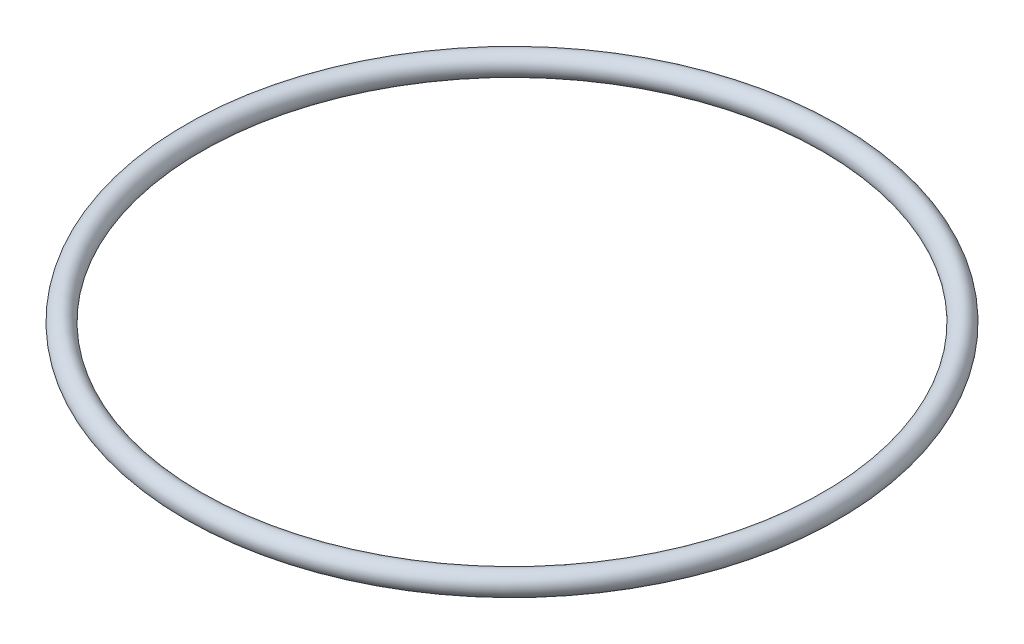
ISO-10303-21;
HEADER;
FILE_DESCRIPTION(('STEP AP214'),'2;1');
FILE_NAME('part.step','',(''),(''),'','','');
FILE_SCHEMA(('AUTOMOTIVE_DESIGN { 1 0 10303 214 1 1 1 1 }'));
ENDSEC;
DATA;
#1=APPLICATION_CONTEXT('core data for automotive mechanical design processes');
#2=APPLICATION_PROTOCOL_DEFINITION('international standard','automotive_design',2000,#1);
#3=PRODUCT_CONTEXT('',#1,'mechanical');
#4=PRODUCT('Part','Part','',(#3));
#5=PRODUCT_RELATED_PRODUCT_CATEGORY('part','',(#4));
#6=PRODUCT_DEFINITION_FORMATION('','',#4);
#7=PRODUCT_DEFINITION_CONTEXT('part definition',#1,'design');
#8=PRODUCT_DEFINITION('design','',#6,#7);
#9=PRODUCT_DEFINITION_SHAPE('','',#8);
#10=(LENGTH_UNIT() NAMED_UNIT(*) SI_UNIT(.MILLI.,.METRE.));
#11=(NAMED_UNIT(*) PLANE_ANGLE_UNIT() SI_UNIT($,.RADIAN.));
#12=(NAMED_UNIT(*) SI_UNIT($,.STERADIAN.) SOLID_ANGLE_UNIT());
#13=UNCERTAINTY_MEASURE_WITH_UNIT(LENGTH_MEASURE(1.E-05),#10,'distance_accuracy_value','');
#14=(GEOMETRIC_REPRESENTATION_CONTEXT(3) GLOBAL_UNCERTAINTY_ASSIGNED_CONTEXT((#13)) GLOBAL_UNIT_ASSIGNED_CONTEXT((#10,
#11,#12)) REPRESENTATION_CONTEXT('',''));
#15=CARTESIAN_POINT('',(0.,0.,0.));
#16=DIRECTION('',(0.,0.,1.));
#17=DIRECTION('',(1.,0.,0.));
#18=AXIS2_PLACEMENT_3D('',#15,#16,#17);
#19=CARTESIAN_POINT('',(0.,0.,0.));
#20=DIRECTION('',(0.,-1.,0.));
#21=DIRECTION('',(0.,0.,-1.00000000000001));
#22=AXIS2_PLACEMENT_3D('',#19,#20,#21);
#23=TOROIDAL_SURFACE('',#22,29.,0.999999999999998);
#24=CARTESIAN_POINT('',(0.,0.,-30.0000000000003));
#25=VERTEX_POINT('',#24);
#26=VERTEX_LOOP('',#25);
#27=FACE_BOUND('',#26,.T.);
#28=ADVANCED_FACE('F32',(#27),#23,.T.);
#29=CLOSED_SHELL('',(#28));
#30=MANIFOLD_SOLID_BREP('B2',#29);
#31=ADVANCED_BREP_SHAPE_REPRESENTATION('',(#18,#30),#14);
#32=SHAPE_DEFINITION_REPRESENTATION(#9,#31);
ENDSEC;
END-ISO-10303-21;
